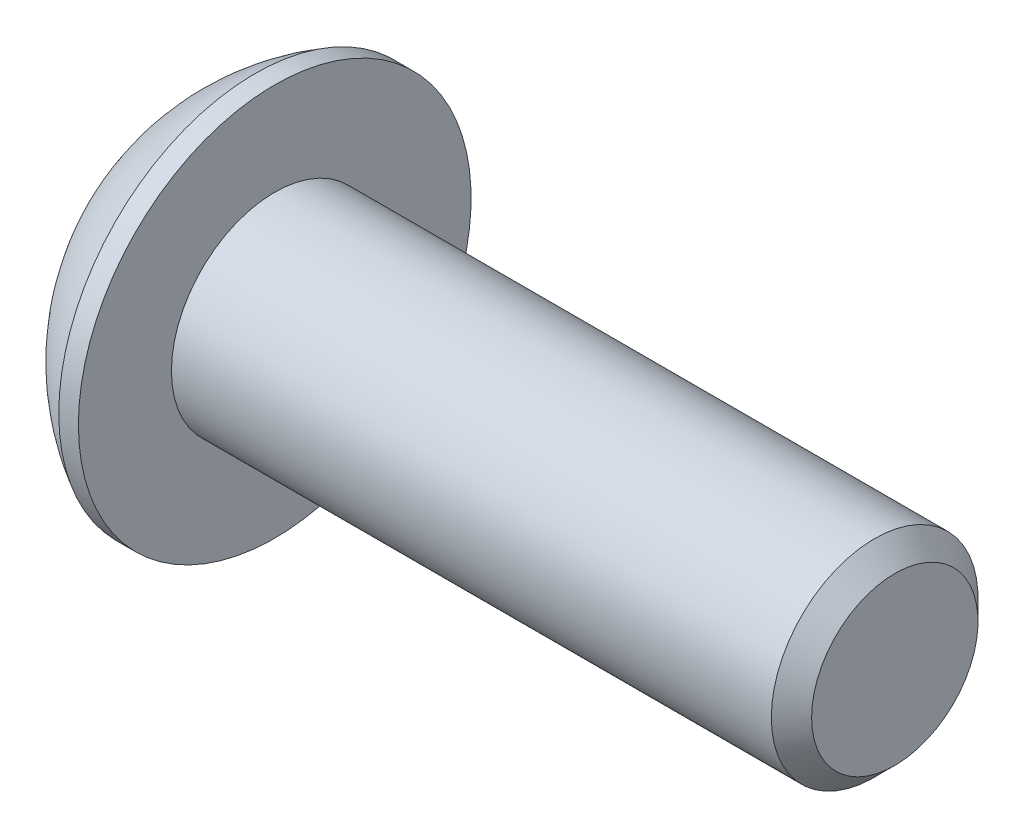
ISO-10303-21;
HEADER;
FILE_DESCRIPTION(('STEP AP214'),'2;1');
FILE_NAME('part.step','',(''),(''),'','','');
FILE_SCHEMA(('AUTOMOTIVE_DESIGN { 1 0 10303 214 1 1 1 1 }'));
ENDSEC;
DATA;
#1=APPLICATION_CONTEXT('core data for automotive mechanical design processes');
#2=APPLICATION_PROTOCOL_DEFINITION('international standard','automotive_design',2000,#1);
#3=PRODUCT_CONTEXT('',#1,'mechanical');
#4=PRODUCT('Part','Part','',(#3));
#5=PRODUCT_RELATED_PRODUCT_CATEGORY('part','',(#4));
#6=PRODUCT_DEFINITION_FORMATION('','',#4);
#7=PRODUCT_DEFINITION_CONTEXT('part definition',#1,'design');
#8=PRODUCT_DEFINITION('design','',#6,#7);
#9=PRODUCT_DEFINITION_SHAPE('','',#8);
#10=(LENGTH_UNIT() NAMED_UNIT(*) SI_UNIT(.MILLI.,.METRE.));
#11=(NAMED_UNIT(*) PLANE_ANGLE_UNIT() SI_UNIT($,.RADIAN.));
#12=(NAMED_UNIT(*) SI_UNIT($,.STERADIAN.) SOLID_ANGLE_UNIT());
#13=UNCERTAINTY_MEASURE_WITH_UNIT(LENGTH_MEASURE(1.E-05),#10,'distance_accuracy_value','');
#14=(GEOMETRIC_REPRESENTATION_CONTEXT(3) GLOBAL_UNCERTAINTY_ASSIGNED_CONTEXT((#13)) GLOBAL_UNIT_ASSIGNED_CONTEXT((#10,
#11,#12)) REPRESENTATION_CONTEXT('',''));
#15=CARTESIAN_POINT('',(0.,0.,0.));
#16=DIRECTION('',(0.,0.,1.));
#17=DIRECTION('',(1.,0.,0.));
#18=AXIS2_PLACEMENT_3D('',#15,#16,#17);
#19=CARTESIAN_POINT('',(0.,0.,0.));
#20=DIRECTION('',(1.,0.,0.));
#21=DIRECTION('',(0.,0.,-1.));
#22=AXIS2_PLACEMENT_3D('',#19,#20,#21);
#23=PLANE('',#22);
#24=DIRECTION('',(0.,0.858326141060322,0.513104507456811));
#25=VECTOR('',#24,1.);
#26=CARTESIAN_POINT('',(0.,-1.26096981374212,0.70268755578798));
#27=LINE('',#26,#25);
#28=CARTESIAN_POINT('',(0.,-1.26096981374212,0.70268755578798));
#29=VERTEX_POINT('',#28);
#30=CARTESIAN_POINT('',(0.,-0.021939632635475,1.44337567));
#31=VERTEX_POINT('',#30);
#32=EDGE_CURVE('E121',#29,#31,#27,.T.);
#33=ORIENTED_EDGE('',*,*,#32,.F.);
#34=DIRECTION('',(0.,-0.0151984677237398,0.99988449661891));
#35=VECTOR('',#34,1.);
#36=CARTESIAN_POINT('',(0.,-1.23903018110665,-0.74068811421202));
#37=LINE('',#36,#35);
#38=CARTESIAN_POINT('',(0.,-1.23903018110665,-0.74068811421202));
#39=VERTEX_POINT('',#38);
#40=EDGE_CURVE('E47',#39,#29,#37,.T.);
#41=ORIENTED_EDGE('',*,*,#40,.F.);
#42=DIRECTION('',(0.,-0.873524608784061,0.486779989162099));
#43=VECTOR('',#42,1.);
#44=CARTESIAN_POINT('',(0.,0.0219396326354754,-1.44337567));
#45=LINE('',#44,#43);
#46=CARTESIAN_POINT('',(0.,0.0219396326354754,-1.44337567));
#47=VERTEX_POINT('',#46);
#48=EDGE_CURVE('E130',#47,#39,#45,.T.);
#49=ORIENTED_EDGE('',*,*,#48,.F.);
#50=DIRECTION('',(0.,-0.858326141060322,-0.513104507456811));
#51=VECTOR('',#50,1.);
#52=CARTESIAN_POINT('',(0.,1.26096981374212,-0.702687555787981));
#53=LINE('',#52,#51);
#54=CARTESIAN_POINT('',(0.,1.26096981374212,-0.702687555787981));
#55=VERTEX_POINT('',#54);
#56=EDGE_CURVE('E128',#55,#47,#53,.T.);
#57=ORIENTED_EDGE('',*,*,#56,.F.);
#58=DIRECTION('',(0.,0.0151984677237398,-0.99988449661891));
#59=VECTOR('',#58,1.);
#60=CARTESIAN_POINT('',(0.,1.23903018110665,0.740688114212019));
#61=LINE('',#60,#59);
#62=CARTESIAN_POINT('',(0.,1.23903018110665,0.740688114212019));
#63=VERTEX_POINT('',#62);
#64=EDGE_CURVE('E95',#63,#55,#61,.T.);
#65=ORIENTED_EDGE('',*,*,#64,.F.);
#66=DIRECTION('',(0.,0.873524608784061,-0.486779989162098));
#67=VECTOR('',#66,1.);
#68=CARTESIAN_POINT('',(0.,-0.021939632635475,1.44337567));
#69=LINE('',#68,#67);
#70=EDGE_CURVE('E124',#31,#63,#69,.T.);
#71=ORIENTED_EDGE('',*,*,#70,.F.);
#72=EDGE_LOOP('',(#33,#41,#49,#57,#65,#71));
#73=FACE_BOUND('',#72,.T.);
#74=CARTESIAN_POINT('',(0.,0.,0.));
#75=DIRECTION('',(-1.,0.,0.));
#76=DIRECTION('',(0.,0.,1.));
#77=AXIS2_PLACEMENT_3D('',#74,#75,#76);
#78=CIRCLE('',#77,1.9);
#79=CARTESIAN_POINT('',(0.,0.,1.9));
#80=VERTEX_POINT('',#79);
#81=EDGE_CURVE('E11',#80,#80,#78,.T.);
#82=ORIENTED_EDGE('',*,*,#81,.T.);
#83=EDGE_LOOP('',(#82));
#84=FACE_BOUND('',#83,.T.);
#85=ADVANCED_FACE('F33',(#73,#84),#23,.F.);
#86=CARTESIAN_POINT('',(3.88527472527473,0.,0.));
#87=DIRECTION('',(-1.,0.,0.));
#88=DIRECTION('',(0.,1.,0.));
#89=AXIS2_PLACEMENT_3D('',#86,#87,#88);
#90=SPHERICAL_SURFACE('',#89,4.32496932831421);
#91=ORIENTED_EDGE('',*,*,#81,.F.);
#92=EDGE_LOOP('',(#91));
#93=FACE_BOUND('',#92,.T.);
#94=CARTESIAN_POINT('',(1.82,0.,0.));
#95=DIRECTION('',(-1.,0.,0.));
#96=DIRECTION('',(0.,0.,1.));
#97=AXIS2_PLACEMENT_3D('',#94,#95,#96);
#98=CIRCLE('',#97,3.8);
#99=CARTESIAN_POINT('',(1.82,0.,3.8));
#100=VERTEX_POINT('',#99);
#101=EDGE_CURVE('E40',#100,#100,#98,.T.);
#102=ORIENTED_EDGE('',*,*,#101,.T.);
#103=EDGE_LOOP('',(#102));
#104=FACE_BOUND('',#103,.T.);
#105=ADVANCED_FACE('F153',(#93,#104),#90,.T.);
#106=CARTESIAN_POINT('',(-2.02471665993733,0.,0.));
#107=DIRECTION('',(-1.,0.,0.));
#108=DIRECTION('',(0.,0.,1.));
#109=AXIS2_PLACEMENT_3D('',#106,#107,#108);
#110=CYLINDRICAL_SURFACE('',#109,3.8);
#111=ORIENTED_EDGE('',*,*,#101,.F.);
#112=EDGE_LOOP('',(#111));
#113=FACE_BOUND('',#112,.T.);
#114=CARTESIAN_POINT('',(2.2,0.,0.));
#115=DIRECTION('',(-1.,0.,0.));
#116=DIRECTION('',(0.,0.,1.));
#117=AXIS2_PLACEMENT_3D('',#114,#115,#116);
#118=CIRCLE('',#117,3.8);
#119=CARTESIAN_POINT('',(2.2,0.,3.8));
#120=VERTEX_POINT('',#119);
#121=EDGE_CURVE('E148',#120,#120,#118,.T.);
#122=ORIENTED_EDGE('',*,*,#121,.T.);
#123=EDGE_LOOP('',(#122));
#124=FACE_BOUND('',#123,.T.);
#125=ADVANCED_FACE('F155',(#113,#124),#110,.T.);
#126=CARTESIAN_POINT('',(2.2,1.99999999999999,0.));
#127=DIRECTION('',(-1.,0.,0.));
#128=DIRECTION('',(0.,0.,1.));
#129=AXIS2_PLACEMENT_3D('',#126,#127,#128);
#130=PLANE('',#129);
#131=ORIENTED_EDGE('',*,*,#121,.F.);
#132=EDGE_LOOP('',(#131));
#133=FACE_BOUND('',#132,.T.);
#134=CARTESIAN_POINT('',(2.2,0.,0.));
#135=DIRECTION('',(-1.,0.,0.));
#136=DIRECTION('',(0.,0.,1.));
#137=AXIS2_PLACEMENT_3D('',#134,#135,#136);
#138=CIRCLE('',#137,1.99999999999999);
#139=CARTESIAN_POINT('',(2.2,0.,1.99999999999999));
#140=VERTEX_POINT('',#139);
#141=EDGE_CURVE('E145',#140,#140,#138,.T.);
#142=ORIENTED_EDGE('',*,*,#141,.T.);
#143=EDGE_LOOP('',(#142));
#144=FACE_BOUND('',#143,.T.);
#145=ADVANCED_FACE('F158',(#133,#144),#130,.F.);
#146=CARTESIAN_POINT('',(-2.02471665993733,0.,0.));
#147=DIRECTION('',(-1.,0.,0.));
#148=DIRECTION('',(0.,0.,1.));
#149=AXIS2_PLACEMENT_3D('',#146,#147,#148);
#150=CYLINDRICAL_SURFACE('',#149,2.);
#151=ORIENTED_EDGE('',*,*,#141,.F.);
#152=EDGE_LOOP('',(#151));
#153=FACE_BOUND('',#152,.T.);
#154=CARTESIAN_POINT('',(13.81,0.,0.));
#155=DIRECTION('',(-1.,0.,0.));
#156=DIRECTION('',(0.,0.,1.));
#157=AXIS2_PLACEMENT_3D('',#154,#155,#156);
#158=CIRCLE('',#157,2.);
#159=CARTESIAN_POINT('',(13.81,0.,2.));
#160=VERTEX_POINT('',#159);
#161=EDGE_CURVE('E142',#160,#160,#158,.T.);
#162=ORIENTED_EDGE('',*,*,#161,.T.);
#163=EDGE_LOOP('',(#162));
#164=FACE_BOUND('',#163,.T.);
#165=ADVANCED_FACE('F164',(#153,#164),#150,.T.);
#166=CARTESIAN_POINT('',(14.2,0.,0.));
#167=DIRECTION('',(-1.,0.,0.));
#168=DIRECTION('',(0.,0.,1.));
#169=AXIS2_PLACEMENT_3D('',#166,#167,#168);
#170=CONICAL_SURFACE('',#169,1.61,0.785398163397447);
#171=ORIENTED_EDGE('',*,*,#161,.F.);
#172=EDGE_LOOP('',(#171));
#173=FACE_BOUND('',#172,.T.);
#174=CARTESIAN_POINT('',(14.2,0.,0.));
#175=DIRECTION('',(-1.,0.,0.));
#176=DIRECTION('',(0.,0.,1.));
#177=AXIS2_PLACEMENT_3D('',#174,#175,#176);
#178=CIRCLE('',#177,1.61);
#179=CARTESIAN_POINT('',(14.2,0.,1.61));
#180=VERTEX_POINT('',#179);
#181=EDGE_CURVE('E134',#180,#180,#178,.T.);
#182=ORIENTED_EDGE('',*,*,#181,.T.);
#183=EDGE_LOOP('',(#182));
#184=FACE_BOUND('',#183,.T.);
#185=ADVANCED_FACE('F170',(#173,#184),#170,.T.);
#186=CARTESIAN_POINT('',(14.2,0.,0.));
#187=DIRECTION('',(-1.,0.,0.));
#188=DIRECTION('',(0.,0.,1.));
#189=AXIS2_PLACEMENT_3D('',#186,#187,#188);
#190=PLANE('',#189);
#191=ORIENTED_EDGE('',*,*,#181,.F.);
#192=EDGE_LOOP('',(#191));
#193=FACE_BOUND('',#192,.T.);
#194=ADVANCED_FACE('F176',(#193),#190,.F.);
#195=CARTESIAN_POINT('',(1.3,-1.23903018110665,-0.74068811421202));
#196=DIRECTION('',(0.,-0.99988449661891,-0.0151984677237398));
#197=DIRECTION('',(0.,0.0151984677237398,-0.99988449661891));
#198=AXIS2_PLACEMENT_3D('',#195,#196,#197);
#199=PLANE('',#198);
#200=ORIENTED_EDGE('',*,*,#40,.T.);
#201=DIRECTION('',(-1.,0.,0.));
#202=VECTOR('',#201,1.);
#203=CARTESIAN_POINT('',(1.3,-1.26096981374212,0.70268755578798));
#204=LINE('',#203,#202);
#205=CARTESIAN_POINT('',(1.3,-1.26096981374212,0.70268755578798));
#206=VERTEX_POINT('',#205);
#207=EDGE_CURVE('E77',#206,#29,#204,.T.);
#208=ORIENTED_EDGE('',*,*,#207,.F.);
#209=DIRECTION('',(0.,-0.0151984677237398,0.99988449661891));
#210=VECTOR('',#209,1.);
#211=CARTESIAN_POINT('',(1.3,-1.23903018110665,-0.74068811421202));
#212=LINE('',#211,#210);
#213=CARTESIAN_POINT('',(1.3,-1.23903018110665,-0.74068811421202));
#214=VERTEX_POINT('',#213);
#215=EDGE_CURVE('E132',#214,#206,#212,.T.);
#216=ORIENTED_EDGE('',*,*,#215,.F.);
#217=DIRECTION('',(-1.,0.,0.));
#218=VECTOR('',#217,1.);
#219=CARTESIAN_POINT('',(1.3,-1.23903018110665,-0.74068811421202));
#220=LINE('',#219,#218);
#221=EDGE_CURVE('E55',#214,#39,#220,.T.);
#222=ORIENTED_EDGE('',*,*,#221,.T.);
#223=EDGE_LOOP('',(#200,#208,#216,#222));
#224=FACE_BOUND('',#223,.T.);
#225=ADVANCED_FACE('F181',(#224),#199,.F.);
#226=CARTESIAN_POINT('',(1.3,0.0219396326354754,-1.44337567));
#227=DIRECTION('',(0.,-0.486779989162099,-0.873524608784061));
#228=DIRECTION('',(0.,0.873524608784061,-0.486779989162099));
#229=AXIS2_PLACEMENT_3D('',#226,#227,#228);
#230=PLANE('',#229);
#231=ORIENTED_EDGE('',*,*,#48,.T.);
#232=ORIENTED_EDGE('',*,*,#221,.F.);
#233=DIRECTION('',(0.,-0.873524608784061,0.486779989162099));
#234=VECTOR('',#233,1.);
#235=CARTESIAN_POINT('',(1.3,0.0219396326354754,-1.44337567));
#236=LINE('',#235,#234);
#237=CARTESIAN_POINT('',(1.3,0.0219396326354754,-1.44337567));
#238=VERTEX_POINT('',#237);
#239=EDGE_CURVE('E107',#238,#214,#236,.T.);
#240=ORIENTED_EDGE('',*,*,#239,.F.);
#241=DIRECTION('',(-1.,0.,0.));
#242=VECTOR('',#241,1.);
#243=CARTESIAN_POINT('',(1.3,0.0219396326354754,-1.44337567));
#244=LINE('',#243,#242);
#245=EDGE_CURVE('E99',#238,#47,#244,.T.);
#246=ORIENTED_EDGE('',*,*,#245,.T.);
#247=EDGE_LOOP('',(#231,#232,#240,#246));
#248=FACE_BOUND('',#247,.T.);
#249=ADVANCED_FACE('F186',(#248),#230,.F.);
#250=CARTESIAN_POINT('',(1.3,1.26096981374212,-0.702687555787981));
#251=DIRECTION('',(0.,0.513104507456811,-0.858326141060322));
#252=DIRECTION('',(0.,0.858326141060322,0.513104507456811));
#253=AXIS2_PLACEMENT_3D('',#250,#251,#252);
#254=PLANE('',#253);
#255=ORIENTED_EDGE('',*,*,#56,.T.);
#256=ORIENTED_EDGE('',*,*,#245,.F.);
#257=DIRECTION('',(0.,-0.858326141060322,-0.513104507456811));
#258=VECTOR('',#257,1.);
#259=CARTESIAN_POINT('',(1.3,1.26096981374212,-0.702687555787981));
#260=LINE('',#259,#258);
#261=CARTESIAN_POINT('',(1.3,1.26096981374212,-0.702687555787981));
#262=VERTEX_POINT('',#261);
#263=EDGE_CURVE('E103',#262,#238,#260,.T.);
#264=ORIENTED_EDGE('',*,*,#263,.F.);
#265=DIRECTION('',(-1.,0.,0.));
#266=VECTOR('',#265,1.);
#267=CARTESIAN_POINT('',(1.3,1.26096981374212,-0.702687555787981));
#268=LINE('',#267,#266);
#269=EDGE_CURVE('E88',#262,#55,#268,.T.);
#270=ORIENTED_EDGE('',*,*,#269,.T.);
#271=EDGE_LOOP('',(#255,#256,#264,#270));
#272=FACE_BOUND('',#271,.T.);
#273=ADVANCED_FACE('F104',(#272),#254,.F.);
#274=CARTESIAN_POINT('',(1.3,1.23903018110665,0.740688114212019));
#275=DIRECTION('',(0.,0.99988449661891,0.0151984677237398));
#276=DIRECTION('',(0.,-0.0151984677237398,0.99988449661891));
#277=AXIS2_PLACEMENT_3D('',#274,#275,#276);
#278=PLANE('',#277);
#279=ORIENTED_EDGE('',*,*,#64,.T.);
#280=ORIENTED_EDGE('',*,*,#269,.F.);
#281=DIRECTION('',(0.,0.0151984677237398,-0.99988449661891));
#282=VECTOR('',#281,1.);
#283=CARTESIAN_POINT('',(1.3,1.23903018110665,0.740688114212019));
#284=LINE('',#283,#282);
#285=CARTESIAN_POINT('',(1.3,1.23903018110665,0.740688114212019));
#286=VERTEX_POINT('',#285);
#287=EDGE_CURVE('E92',#286,#262,#284,.T.);
#288=ORIENTED_EDGE('',*,*,#287,.F.);
#289=DIRECTION('',(-1.,0.,0.));
#290=VECTOR('',#289,1.);
#291=CARTESIAN_POINT('',(1.3,1.23903018110665,0.740688114212019));
#292=LINE('',#291,#290);
#293=EDGE_CURVE('E100',#286,#63,#292,.T.);
#294=ORIENTED_EDGE('',*,*,#293,.T.);
#295=EDGE_LOOP('',(#279,#280,#288,#294));
#296=FACE_BOUND('',#295,.T.);
#297=ADVANCED_FACE('F90',(#296),#278,.F.);
#298=CARTESIAN_POINT('',(1.3,-0.021939632635475,1.44337567));
#299=DIRECTION('',(0.,0.486779989162099,0.873524608784061));
#300=DIRECTION('',(0.,-0.873524608784061,0.486779989162099));
#301=AXIS2_PLACEMENT_3D('',#298,#299,#300);
#302=PLANE('',#301);
#303=ORIENTED_EDGE('',*,*,#70,.T.);
#304=ORIENTED_EDGE('',*,*,#293,.F.);
#305=DIRECTION('',(0.,0.873524608784061,-0.486779989162098));
#306=VECTOR('',#305,1.);
#307=CARTESIAN_POINT('',(1.3,-0.021939632635475,1.44337567));
#308=LINE('',#307,#306);
#309=CARTESIAN_POINT('',(1.3,-0.021939632635475,1.44337567));
#310=VERTEX_POINT('',#309);
#311=EDGE_CURVE('E113',#310,#286,#308,.T.);
#312=ORIENTED_EDGE('',*,*,#311,.F.);
#313=DIRECTION('',(-1.,0.,0.));
#314=VECTOR('',#313,1.);
#315=CARTESIAN_POINT('',(1.3,-0.021939632635475,1.44337567));
#316=LINE('',#315,#314);
#317=EDGE_CURVE('E137',#310,#31,#316,.T.);
#318=ORIENTED_EDGE('',*,*,#317,.T.);
#319=EDGE_LOOP('',(#303,#304,#312,#318));
#320=FACE_BOUND('',#319,.T.);
#321=ADVANCED_FACE('F212',(#320),#302,.F.);
#322=CARTESIAN_POINT('',(1.3,-1.26096981374212,0.70268755578798));
#323=DIRECTION('',(0.,-0.513104507456811,0.858326141060322));
#324=DIRECTION('',(0.,-0.858326141060322,-0.513104507456811));
#325=AXIS2_PLACEMENT_3D('',#322,#323,#324);
#326=PLANE('',#325);
#327=ORIENTED_EDGE('',*,*,#32,.T.);
#328=ORIENTED_EDGE('',*,*,#317,.F.);
#329=DIRECTION('',(0.,0.858326141060322,0.513104507456811));
#330=VECTOR('',#329,1.);
#331=CARTESIAN_POINT('',(1.3,-1.26096981374212,0.70268755578798));
#332=LINE('',#331,#330);
#333=EDGE_CURVE('E115',#206,#310,#332,.T.);
#334=ORIENTED_EDGE('',*,*,#333,.F.);
#335=ORIENTED_EDGE('',*,*,#207,.T.);
#336=EDGE_LOOP('',(#327,#328,#334,#335));
#337=FACE_BOUND('',#336,.T.);
#338=ADVANCED_FACE('F200',(#337),#326,.F.);
#339=CARTESIAN_POINT('',(1.3,0.,0.));
#340=DIRECTION('',(-1.,0.,0.));
#341=DIRECTION('',(0.,0.,1.));
#342=AXIS2_PLACEMENT_3D('',#339,#340,#341);
#343=PLANE('',#342);
#344=ORIENTED_EDGE('',*,*,#215,.T.);
#345=ORIENTED_EDGE('',*,*,#333,.T.);
#346=ORIENTED_EDGE('',*,*,#311,.T.);
#347=ORIENTED_EDGE('',*,*,#287,.T.);
#348=ORIENTED_EDGE('',*,*,#263,.T.);
#349=ORIENTED_EDGE('',*,*,#239,.T.);
#350=EDGE_LOOP('',(#344,#345,#346,#347,#348,#349));
#351=FACE_BOUND('',#350,.T.);
#352=ADVANCED_FACE('F110',(#351),#343,.T.);
#353=CLOSED_SHELL('',(#85,#105,#125,#145,#165,#185,#194,#225,#249,#273,#297,#321,#338,#352));
#354=MANIFOLD_SOLID_BREP('B2',#353);
#355=ADVANCED_BREP_SHAPE_REPRESENTATION('',(#18,#354),#14);
#356=SHAPE_DEFINITION_REPRESENTATION(#9,#355);
ENDSEC;
END-ISO-10303-21;
